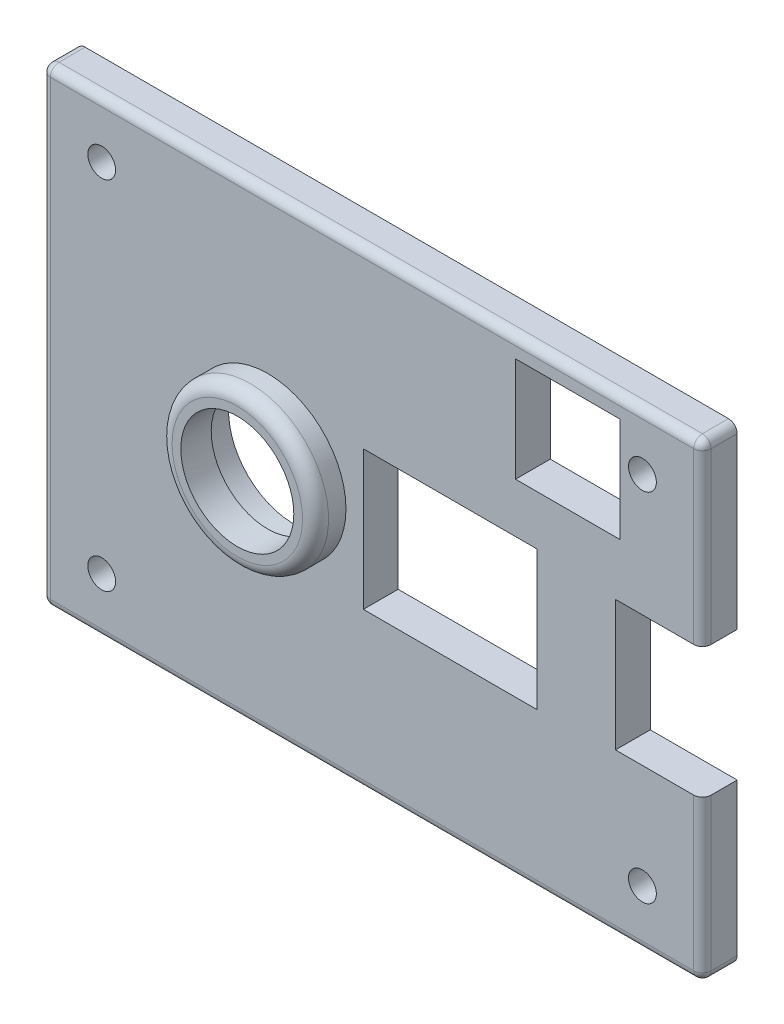
ISO-10303-21;
HEADER;
FILE_DESCRIPTION(('STEP AP214'),'2;1');
FILE_NAME('part.step','',(''),(''),'','','');
FILE_SCHEMA(('AUTOMOTIVE_DESIGN { 1 0 10303 214 1 1 1 1 }'));
ENDSEC;
DATA;
#1=APPLICATION_CONTEXT('core data for automotive mechanical design processes');
#2=APPLICATION_PROTOCOL_DEFINITION('international standard','automotive_design',2000,#1);
#3=PRODUCT_CONTEXT('',#1,'mechanical');
#4=PRODUCT('Part','Part','',(#3));
#5=PRODUCT_RELATED_PRODUCT_CATEGORY('part','',(#4));
#6=PRODUCT_DEFINITION_FORMATION('','',#4);
#7=PRODUCT_DEFINITION_CONTEXT('part definition',#1,'design');
#8=PRODUCT_DEFINITION('design','',#6,#7);
#9=PRODUCT_DEFINITION_SHAPE('','',#8);
#10=(LENGTH_UNIT() NAMED_UNIT(*) SI_UNIT(.MILLI.,.METRE.));
#11=(NAMED_UNIT(*) PLANE_ANGLE_UNIT() SI_UNIT($,.RADIAN.));
#12=(NAMED_UNIT(*) SI_UNIT($,.STERADIAN.) SOLID_ANGLE_UNIT());
#13=UNCERTAINTY_MEASURE_WITH_UNIT(LENGTH_MEASURE(1.E-05),#10,'distance_accuracy_value','');
#14=(GEOMETRIC_REPRESENTATION_CONTEXT(3) GLOBAL_UNCERTAINTY_ASSIGNED_CONTEXT((#13)) GLOBAL_UNIT_ASSIGNED_CONTEXT((#10,
#11,#12)) REPRESENTATION_CONTEXT('',''));
#15=CARTESIAN_POINT('',(0.,0.,0.));
#16=DIRECTION('',(0.,0.,1.));
#17=DIRECTION('',(1.,0.,0.));
#18=AXIS2_PLACEMENT_3D('',#15,#16,#17);
#19=CARTESIAN_POINT('',(38.,27.,4.));
#20=DIRECTION('',(-1.,0.,0.));
#21=DIRECTION('',(0.,-1.,0.));
#22=AXIS2_PLACEMENT_3D('',#19,#20,#21);
#23=PLANE('',#22);
#24=DIRECTION('',(0.,1.,0.));
#25=VECTOR('',#24,1.);
#26=CARTESIAN_POINT('',(38.,-26.,3.));
#27=LINE('',#26,#25);
#28=CARTESIAN_POINT('',(38.,-8.5,3.));
#29=VERTEX_POINT('',#28);
#30=CARTESIAN_POINT('',(38.,-26.,3.));
#31=VERTEX_POINT('',#30);
#32=EDGE_CURVE('E422',#29,#31,#27,.F.);
#33=ORIENTED_EDGE('',*,*,#32,.T.);
#34=DIRECTION('',(0.,0.,-1.));
#35=VECTOR('',#34,1.);
#36=CARTESIAN_POINT('',(38.,-26.,4.));
#37=LINE('',#36,#35);
#38=CARTESIAN_POINT('',(38.,-26.,0.));
#39=VERTEX_POINT('',#38);
#40=EDGE_CURVE('E429',#31,#39,#37,.T.);
#41=ORIENTED_EDGE('',*,*,#40,.T.);
#42=DIRECTION('',(0.,1.,0.));
#43=VECTOR('',#42,1.);
#44=CARTESIAN_POINT('',(38.,27.,0.));
#45=LINE('',#44,#43);
#46=CARTESIAN_POINT('',(38.,-8.5,0.));
#47=VERTEX_POINT('',#46);
#48=EDGE_CURVE('E343',#39,#47,#45,.T.);
#49=ORIENTED_EDGE('',*,*,#48,.T.);
#50=DIRECTION('',(0.,0.,1.));
#51=VECTOR('',#50,1.);
#52=CARTESIAN_POINT('',(38.,-8.5,0.));
#53=LINE('',#52,#51);
#54=EDGE_CURVE('E249',#47,#29,#53,.T.);
#55=ORIENTED_EDGE('',*,*,#54,.T.);
#56=EDGE_LOOP('',(#33,#41,#49,#55));
#57=FACE_BOUND('',#56,.T.);
#58=ADVANCED_FACE('F39',(#57),#23,.F.);
#59=CARTESIAN_POINT('',(38.,6.5,0.));
#60=VERTEX_POINT('',#59);
#61=CARTESIAN_POINT('',(38.,26.,0.));
#62=VERTEX_POINT('',#61);
#63=EDGE_CURVE('E340',#60,#62,#45,.T.);
#64=ORIENTED_EDGE('',*,*,#63,.T.);
#65=DIRECTION('',(0.,0.,-1.));
#66=VECTOR('',#65,1.);
#67=CARTESIAN_POINT('',(38.,26.,4.));
#68=LINE('',#67,#66);
#69=CARTESIAN_POINT('',(38.,26.,3.));
#70=VERTEX_POINT('',#69);
#71=EDGE_CURVE('E414',#62,#70,#68,.F.);
#72=ORIENTED_EDGE('',*,*,#71,.T.);
#73=DIRECTION('',(0.,1.,0.));
#74=VECTOR('',#73,1.);
#75=CARTESIAN_POINT('',(38.,6.5,3.));
#76=LINE('',#75,#74);
#77=CARTESIAN_POINT('',(38.,6.5,3.));
#78=VERTEX_POINT('',#77);
#79=EDGE_CURVE('E412',#70,#78,#76,.F.);
#80=ORIENTED_EDGE('',*,*,#79,.T.);
#81=DIRECTION('',(0.,0.,1.));
#82=VECTOR('',#81,1.);
#83=CARTESIAN_POINT('',(38.,6.5,0.));
#84=LINE('',#83,#82);
#85=EDGE_CURVE('E274',#60,#78,#84,.T.);
#86=ORIENTED_EDGE('',*,*,#85,.F.);
#87=EDGE_LOOP('',(#64,#72,#80,#86));
#88=FACE_BOUND('',#87,.T.);
#89=ADVANCED_FACE('F499',(#88),#23,.F.);
#90=CARTESIAN_POINT('',(-38.,27.,4.));
#91=DIRECTION('',(0.,-1.,0.));
#92=DIRECTION('',(0.,0.,-1.));
#93=AXIS2_PLACEMENT_3D('',#90,#91,#92);
#94=PLANE('',#93);
#95=DIRECTION('',(-1.,0.,0.));
#96=VECTOR('',#95,1.);
#97=CARTESIAN_POINT('',(38.,27.,3.));
#98=LINE('',#97,#96);
#99=CARTESIAN_POINT('',(-37.,27.,3.));
#100=VERTEX_POINT('',#99);
#101=CARTESIAN_POINT('',(37.,27.,3.));
#102=VERTEX_POINT('',#101);
#103=EDGE_CURVE('E364',#100,#102,#98,.F.);
#104=ORIENTED_EDGE('',*,*,#103,.T.);
#105=DIRECTION('',(0.,0.,-1.));
#106=VECTOR('',#105,1.);
#107=CARTESIAN_POINT('',(37.,27.,4.));
#108=LINE('',#107,#106);
#109=CARTESIAN_POINT('',(37.,27.,0.));
#110=VERTEX_POINT('',#109);
#111=EDGE_CURVE('E395',#102,#110,#108,.T.);
#112=ORIENTED_EDGE('',*,*,#111,.T.);
#113=DIRECTION('',(-1.,0.,0.));
#114=VECTOR('',#113,1.);
#115=CARTESIAN_POINT('',(-38.,27.,0.));
#116=LINE('',#115,#114);
#117=CARTESIAN_POINT('',(-37.,27.,0.));
#118=VERTEX_POINT('',#117);
#119=EDGE_CURVE('E345',#110,#118,#116,.T.);
#120=ORIENTED_EDGE('',*,*,#119,.T.);
#121=DIRECTION('',(0.,0.,-1.));
#122=VECTOR('',#121,1.);
#123=CARTESIAN_POINT('',(-37.,27.,4.));
#124=LINE('',#123,#122);
#125=EDGE_CURVE('E383',#118,#100,#124,.F.);
#126=ORIENTED_EDGE('',*,*,#125,.T.);
#127=EDGE_LOOP('',(#104,#112,#120,#126));
#128=FACE_BOUND('',#127,.T.);
#129=ADVANCED_FACE('F504',(#128),#94,.F.);
#130=CARTESIAN_POINT('',(-38.,27.,4.));
#131=DIRECTION('',(1.,0.,0.));
#132=DIRECTION('',(0.,1.,0.));
#133=AXIS2_PLACEMENT_3D('',#130,#131,#132);
#134=PLANE('',#133);
#135=DIRECTION('',(0.,-1.,0.));
#136=VECTOR('',#135,1.);
#137=CARTESIAN_POINT('',(-38.,26.,3.));
#138=LINE('',#137,#136);
#139=CARTESIAN_POINT('',(-38.,-26.,3.));
#140=VERTEX_POINT('',#139);
#141=CARTESIAN_POINT('',(-38.,26.,3.));
#142=VERTEX_POINT('',#141);
#143=EDGE_CURVE('E371',#140,#142,#138,.F.);
#144=ORIENTED_EDGE('',*,*,#143,.T.);
#145=DIRECTION('',(0.,0.,-1.));
#146=VECTOR('',#145,1.);
#147=CARTESIAN_POINT('',(-38.,26.,4.));
#148=LINE('',#147,#146);
#149=CARTESIAN_POINT('',(-38.,26.,0.));
#150=VERTEX_POINT('',#149);
#151=EDGE_CURVE('E375',#142,#150,#148,.T.);
#152=ORIENTED_EDGE('',*,*,#151,.T.);
#153=DIRECTION('',(0.,-1.,0.));
#154=VECTOR('',#153,1.);
#155=CARTESIAN_POINT('',(-38.,27.,0.));
#156=LINE('',#155,#154);
#157=CARTESIAN_POINT('',(-38.,-26.,0.));
#158=VERTEX_POINT('',#157);
#159=EDGE_CURVE('E347',#150,#158,#156,.T.);
#160=ORIENTED_EDGE('',*,*,#159,.T.);
#161=DIRECTION('',(0.,0.,-1.));
#162=VECTOR('',#161,1.);
#163=CARTESIAN_POINT('',(-38.,-26.,4.));
#164=LINE('',#163,#162);
#165=EDGE_CURVE('E373',#158,#140,#164,.F.);
#166=ORIENTED_EDGE('',*,*,#165,.T.);
#167=EDGE_LOOP('',(#144,#152,#160,#166));
#168=FACE_BOUND('',#167,.T.);
#169=ADVANCED_FACE('F775',(#168),#134,.F.);
#170=CARTESIAN_POINT('',(-38.,-27.,4.));
#171=DIRECTION('',(0.,1.,0.));
#172=DIRECTION('',(0.,0.,1.));
#173=AXIS2_PLACEMENT_3D('',#170,#171,#172);
#174=PLANE('',#173);
#175=DIRECTION('',(1.,0.,0.));
#176=VECTOR('',#175,1.);
#177=CARTESIAN_POINT('',(-38.,-27.,0.));
#178=LINE('',#177,#176);
#179=CARTESIAN_POINT('',(-37.,-27.,0.));
#180=VERTEX_POINT('',#179);
#181=CARTESIAN_POINT('',(37.,-27.,0.));
#182=VERTEX_POINT('',#181);
#183=EDGE_CURVE('E350',#180,#182,#178,.T.);
#184=ORIENTED_EDGE('',*,*,#183,.T.);
#185=DIRECTION('',(0.,0.,-1.));
#186=VECTOR('',#185,1.);
#187=CARTESIAN_POINT('',(37.,-27.,4.));
#188=LINE('',#187,#186);
#189=CARTESIAN_POINT('',(37.,-27.,3.));
#190=VERTEX_POINT('',#189);
#191=EDGE_CURVE('E434',#182,#190,#188,.F.);
#192=ORIENTED_EDGE('',*,*,#191,.T.);
#193=DIRECTION('',(1.,0.,0.));
#194=VECTOR('',#193,1.);
#195=CARTESIAN_POINT('',(-38.,-27.,3.));
#196=LINE('',#195,#194);
#197=CARTESIAN_POINT('',(-37.,-27.,3.));
#198=VERTEX_POINT('',#197);
#199=EDGE_CURVE('E369',#190,#198,#196,.F.);
#200=ORIENTED_EDGE('',*,*,#199,.T.);
#201=DIRECTION('',(0.,0.,-1.));
#202=VECTOR('',#201,1.);
#203=CARTESIAN_POINT('',(-37.,-27.,4.));
#204=LINE('',#203,#202);
#205=EDGE_CURVE('E388',#198,#180,#204,.T.);
#206=ORIENTED_EDGE('',*,*,#205,.T.);
#207=EDGE_LOOP('',(#184,#192,#200,#206));
#208=FACE_BOUND('',#207,.T.);
#209=ADVANCED_FACE('F467',(#208),#174,.F.);
#210=CARTESIAN_POINT('',(0.,0.,4.));
#211=DIRECTION('',(0.,0.,1.));
#212=DIRECTION('',(1.,0.,0.));
#213=AXIS2_PLACEMENT_3D('',#210,#211,#212);
#214=PLANE('',#213);
#215=CARTESIAN_POINT('',(-12.,0.,4.));
#216=DIRECTION('',(0.,0.,1.));
#217=DIRECTION('',(1.,0.,0.));
#218=AXIS2_PLACEMENT_3D('',#215,#216,#217);
#219=CIRCLE('',#218,9.);
#220=CARTESIAN_POINT('',(-3.,0.,4.));
#221=VERTEX_POINT('',#220);
#222=EDGE_CURVE('E353',#221,#221,#219,.T.);
#223=ORIENTED_EDGE('',*,*,#222,.F.);
#224=EDGE_LOOP('',(#223));
#225=FACE_BOUND('',#224,.T.);
#226=DIRECTION('',(0.,1.,0.));
#227=VECTOR('',#226,1.);
#228=CARTESIAN_POINT('',(19.,7.,4.));
#229=LINE('',#228,#227);
#230=CARTESIAN_POINT('',(19.,-9.,4.));
#231=VERTEX_POINT('',#230);
#232=CARTESIAN_POINT('',(19.,7.,4.));
#233=VERTEX_POINT('',#232);
#234=EDGE_CURVE('E246',#231,#233,#229,.T.);
#235=ORIENTED_EDGE('',*,*,#234,.F.);
#236=DIRECTION('',(1.,0.,0.));
#237=VECTOR('',#236,1.);
#238=CARTESIAN_POINT('',(-1.00000000000002,-9.,4.));
#239=LINE('',#238,#237);
#240=CARTESIAN_POINT('',(-1.00000000000002,-9.,4.));
#241=VERTEX_POINT('',#240);
#242=EDGE_CURVE('E236',#241,#231,#239,.T.);
#243=ORIENTED_EDGE('',*,*,#242,.F.);
#244=DIRECTION('',(0.,-1.,0.));
#245=VECTOR('',#244,1.);
#246=CARTESIAN_POINT('',(-1.00000000000002,7.,4.));
#247=LINE('',#246,#245);
#248=CARTESIAN_POINT('',(-1.00000000000002,7.,4.));
#249=VERTEX_POINT('',#248);
#250=EDGE_CURVE('E252',#249,#241,#247,.T.);
#251=ORIENTED_EDGE('',*,*,#250,.F.);
#252=DIRECTION('',(-1.,0.,0.));
#253=VECTOR('',#252,1.);
#254=CARTESIAN_POINT('',(-1.00000000000002,7.,4.));
#255=LINE('',#254,#253);
#256=EDGE_CURVE('E248',#233,#249,#255,.T.);
#257=ORIENTED_EDGE('',*,*,#256,.F.);
#258=EDGE_LOOP('',(#235,#243,#251,#257));
#259=FACE_BOUND('',#258,.T.);
#260=DIRECTION('',(1.,0.,0.));
#261=VECTOR('',#260,1.);
#262=CARTESIAN_POINT('',(38.,-26.,4.));
#263=LINE('',#262,#261);
#264=CARTESIAN_POINT('',(-37.,-26.,4.));
#265=VERTEX_POINT('',#264);
#266=CARTESIAN_POINT('',(37.,-26.,4.));
#267=VERTEX_POINT('',#266);
#268=EDGE_CURVE('E367',#265,#267,#263,.T.);
#269=ORIENTED_EDGE('',*,*,#268,.T.);
#270=DIRECTION('',(0.,1.,0.));
#271=VECTOR('',#270,1.);
#272=CARTESIAN_POINT('',(37.,-8.5,4.));
#273=LINE('',#272,#271);
#274=CARTESIAN_POINT('',(37.,-8.5,4.));
#275=VERTEX_POINT('',#274);
#276=EDGE_CURVE('E48',#267,#275,#273,.T.);
#277=ORIENTED_EDGE('',*,*,#276,.T.);
#278=DIRECTION('',(1.,0.,0.));
#279=VECTOR('',#278,1.);
#280=CARTESIAN_POINT('',(28.,-8.5,4.));
#281=LINE('',#280,#279);
#282=CARTESIAN_POINT('',(28.,-8.5,4.));
#283=VERTEX_POINT('',#282);
#284=EDGE_CURVE('E268',#283,#275,#281,.T.);
#285=ORIENTED_EDGE('',*,*,#284,.F.);
#286=DIRECTION('',(0.,-1.,0.));
#287=VECTOR('',#286,1.);
#288=CARTESIAN_POINT('',(28.,6.5,4.));
#289=LINE('',#288,#287);
#290=CARTESIAN_POINT('',(28.,6.5,4.));
#291=VERTEX_POINT('',#290);
#292=EDGE_CURVE('E277',#291,#283,#289,.T.);
#293=ORIENTED_EDGE('',*,*,#292,.F.);
#294=DIRECTION('',(-1.,0.,0.));
#295=VECTOR('',#294,1.);
#296=CARTESIAN_POINT('',(28.,6.5,4.));
#297=LINE('',#296,#295);
#298=CARTESIAN_POINT('',(37.,6.5,4.));
#299=VERTEX_POINT('',#298);
#300=EDGE_CURVE('E275',#299,#291,#297,.T.);
#301=ORIENTED_EDGE('',*,*,#300,.F.);
#302=DIRECTION('',(0.,1.,0.));
#303=VECTOR('',#302,1.);
#304=CARTESIAN_POINT('',(37.,26.,4.));
#305=LINE('',#304,#303);
#306=CARTESIAN_POINT('',(37.,26.,4.));
#307=VERTEX_POINT('',#306);
#308=EDGE_CURVE('E418',#299,#307,#305,.T.);
#309=ORIENTED_EDGE('',*,*,#308,.T.);
#310=DIRECTION('',(-1.,0.,0.));
#311=VECTOR('',#310,1.);
#312=CARTESIAN_POINT('',(-38.,26.,4.));
#313=LINE('',#312,#311);
#314=CARTESIAN_POINT('',(-37.,26.,4.));
#315=VERTEX_POINT('',#314);
#316=EDGE_CURVE('E362',#307,#315,#313,.T.);
#317=ORIENTED_EDGE('',*,*,#316,.T.);
#318=DIRECTION('',(0.,-1.,0.));
#319=VECTOR('',#318,1.);
#320=CARTESIAN_POINT('',(-37.,-26.,4.));
#321=LINE('',#320,#319);
#322=EDGE_CURVE('E393',#315,#265,#321,.T.);
#323=ORIENTED_EDGE('',*,*,#322,.T.);
#324=EDGE_LOOP('',(#269,#277,#285,#293,#301,#309,#317,#323));
#325=FACE_BOUND('',#324,.T.);
#326=DIRECTION('',(0.,1.,0.));
#327=VECTOR('',#326,1.);
#328=CARTESIAN_POINT('',(28.5,24.714,4.));
#329=LINE('',#328,#327);
#330=CARTESIAN_POINT('',(28.5,12.714,4.));
#331=VERTEX_POINT('',#330);
#332=CARTESIAN_POINT('',(28.5,24.714,4.));
#333=VERTEX_POINT('',#332);
#334=EDGE_CURVE('E222',#331,#333,#329,.T.);
#335=ORIENTED_EDGE('',*,*,#334,.F.);
#336=DIRECTION('',(1.,0.,0.));
#337=VECTOR('',#336,1.);
#338=CARTESIAN_POINT('',(16.5,12.714,4.));
#339=LINE('',#338,#337);
#340=CARTESIAN_POINT('',(16.5,12.714,4.));
#341=VERTEX_POINT('',#340);
#342=EDGE_CURVE('E295',#341,#331,#339,.T.);
#343=ORIENTED_EDGE('',*,*,#342,.F.);
#344=DIRECTION('',(0.,-1.,0.));
#345=VECTOR('',#344,1.);
#346=CARTESIAN_POINT('',(16.5,24.714,4.));
#347=LINE('',#346,#345);
#348=CARTESIAN_POINT('',(16.5,24.714,4.));
#349=VERTEX_POINT('',#348);
#350=EDGE_CURVE('E307',#349,#341,#347,.T.);
#351=ORIENTED_EDGE('',*,*,#350,.F.);
#352=DIRECTION('',(-1.,0.,0.));
#353=VECTOR('',#352,1.);
#354=CARTESIAN_POINT('',(16.5,24.714,4.));
#355=LINE('',#354,#353);
#356=EDGE_CURVE('E223',#333,#349,#355,.T.);
#357=ORIENTED_EDGE('',*,*,#356,.F.);
#358=EDGE_LOOP('',(#335,#343,#351,#357));
#359=FACE_BOUND('',#358,.T.);
#360=CARTESIAN_POINT('',(-31.1,-20.5,4.));
#361=DIRECTION('',(0.,0.,1.));
#362=DIRECTION('',(1.,0.,0.));
#363=AXIS2_PLACEMENT_3D('',#360,#361,#362);
#364=CIRCLE('',#363,1.6);
#365=CARTESIAN_POINT('',(-29.5,-20.5,4.));
#366=VERTEX_POINT('',#365);
#367=EDGE_CURVE('E230',#366,#366,#364,.T.);
#368=ORIENTED_EDGE('',*,*,#367,.F.);
#369=EDGE_LOOP('',(#368));
#370=FACE_BOUND('',#369,.T.);
#371=CARTESIAN_POINT('',(31.1,-20.5,4.));
#372=DIRECTION('',(0.,0.,1.));
#373=DIRECTION('',(1.,0.,0.));
#374=AXIS2_PLACEMENT_3D('',#371,#372,#373);
#375=CIRCLE('',#374,1.6);
#376=CARTESIAN_POINT('',(32.7,-20.5,4.));
#377=VERTEX_POINT('',#376);
#378=EDGE_CURVE('E329',#377,#377,#375,.T.);
#379=ORIENTED_EDGE('',*,*,#378,.F.);
#380=EDGE_LOOP('',(#379));
#381=FACE_BOUND('',#380,.T.);
#382=CARTESIAN_POINT('',(31.1,20.5,4.));
#383=DIRECTION('',(0.,0.,1.));
#384=DIRECTION('',(1.,0.,0.));
#385=AXIS2_PLACEMENT_3D('',#382,#383,#384);
#386=CIRCLE('',#385,1.6);
#387=CARTESIAN_POINT('',(32.7,20.5,4.));
#388=VERTEX_POINT('',#387);
#389=EDGE_CURVE('E323',#388,#388,#386,.T.);
#390=ORIENTED_EDGE('',*,*,#389,.F.);
#391=EDGE_LOOP('',(#390));
#392=FACE_BOUND('',#391,.T.);
#393=CARTESIAN_POINT('',(-31.1,20.5,4.));
#394=DIRECTION('',(0.,0.,1.));
#395=DIRECTION('',(1.,0.,0.));
#396=AXIS2_PLACEMENT_3D('',#393,#394,#395);
#397=CIRCLE('',#396,1.6);
#398=CARTESIAN_POINT('',(-29.5,20.5,4.));
#399=VERTEX_POINT('',#398);
#400=EDGE_CURVE('E322',#399,#399,#397,.T.);
#401=ORIENTED_EDGE('',*,*,#400,.F.);
#402=EDGE_LOOP('',(#401));
#403=FACE_BOUND('',#402,.T.);
#404=ADVANCED_FACE('F464',(#225,#259,#325,#359,#370,#381,#392,#403),#214,.T.);
#405=CARTESIAN_POINT('',(0.,0.,0.));
#406=DIRECTION('',(0.,0.,1.));
#407=DIRECTION('',(1.,0.,0.));
#408=AXIS2_PLACEMENT_3D('',#405,#406,#407);
#409=PLANE('',#408);
#410=CARTESIAN_POINT('',(-13.,-1.,0.));
#411=DIRECTION('',(0.,0.,1.));
#412=DIRECTION('',(1.,0.,0.));
#413=AXIS2_PLACEMENT_3D('',#410,#411,#412);
#414=CIRCLE('',#413,7.5);
#415=CARTESIAN_POINT('',(-5.50000000000002,-1.,0.));
#416=VERTEX_POINT('',#415);
#417=EDGE_CURVE('E227',#416,#416,#414,.T.);
#418=ORIENTED_EDGE('',*,*,#417,.T.);
#419=EDGE_LOOP('',(#418));
#420=FACE_BOUND('',#419,.T.);
#421=DIRECTION('',(1.,0.,0.));
#422=VECTOR('',#421,1.);
#423=CARTESIAN_POINT('',(-1.00000000000002,-9.,0.));
#424=LINE('',#423,#422);
#425=CARTESIAN_POINT('',(-1.00000000000002,-9.,0.));
#426=VERTEX_POINT('',#425);
#427=CARTESIAN_POINT('',(19.,-9.,0.));
#428=VERTEX_POINT('',#427);
#429=EDGE_CURVE('E242',#426,#428,#424,.T.);
#430=ORIENTED_EDGE('',*,*,#429,.T.);
#431=DIRECTION('',(0.,1.,0.));
#432=VECTOR('',#431,1.);
#433=CARTESIAN_POINT('',(19.,7.,0.));
#434=LINE('',#433,#432);
#435=CARTESIAN_POINT('',(19.,7.,0.));
#436=VERTEX_POINT('',#435);
#437=EDGE_CURVE('E232',#428,#436,#434,.T.);
#438=ORIENTED_EDGE('',*,*,#437,.T.);
#439=DIRECTION('',(-1.,0.,0.));
#440=VECTOR('',#439,1.);
#441=CARTESIAN_POINT('',(-1.00000000000002,7.,0.));
#442=LINE('',#441,#440);
#443=CARTESIAN_POINT('',(-1.00000000000002,7.,0.));
#444=VERTEX_POINT('',#443);
#445=EDGE_CURVE('E235',#436,#444,#442,.T.);
#446=ORIENTED_EDGE('',*,*,#445,.T.);
#447=DIRECTION('',(0.,-1.,0.));
#448=VECTOR('',#447,1.);
#449=CARTESIAN_POINT('',(-1.00000000000002,7.,0.));
#450=LINE('',#449,#448);
#451=EDGE_CURVE('E239',#444,#426,#450,.T.);
#452=ORIENTED_EDGE('',*,*,#451,.T.);
#453=EDGE_LOOP('',(#430,#438,#446,#452));
#454=FACE_BOUND('',#453,.T.);
#455=DIRECTION('',(1.,0.,0.));
#456=VECTOR('',#455,1.);
#457=CARTESIAN_POINT('',(16.5,12.714,0.));
#458=LINE('',#457,#456);
#459=CARTESIAN_POINT('',(16.5,12.714,0.));
#460=VERTEX_POINT('',#459);
#461=CARTESIAN_POINT('',(28.5,12.714,0.));
#462=VERTEX_POINT('',#461);
#463=EDGE_CURVE('E301',#460,#462,#458,.T.);
#464=ORIENTED_EDGE('',*,*,#463,.T.);
#465=DIRECTION('',(0.,1.,0.));
#466=VECTOR('',#465,1.);
#467=CARTESIAN_POINT('',(28.5,24.714,0.));
#468=LINE('',#467,#466);
#469=CARTESIAN_POINT('',(28.5,24.714,0.));
#470=VERTEX_POINT('',#469);
#471=EDGE_CURVE('E291',#462,#470,#468,.T.);
#472=ORIENTED_EDGE('',*,*,#471,.T.);
#473=DIRECTION('',(-1.,0.,0.));
#474=VECTOR('',#473,1.);
#475=CARTESIAN_POINT('',(16.5,24.714,0.));
#476=LINE('',#475,#474);
#477=CARTESIAN_POINT('',(16.5,24.714,0.));
#478=VERTEX_POINT('',#477);
#479=EDGE_CURVE('E294',#470,#478,#476,.T.);
#480=ORIENTED_EDGE('',*,*,#479,.T.);
#481=DIRECTION('',(0.,-1.,0.));
#482=VECTOR('',#481,1.);
#483=CARTESIAN_POINT('',(16.5,24.714,0.));
#484=LINE('',#483,#482);
#485=EDGE_CURVE('E298',#478,#460,#484,.T.);
#486=ORIENTED_EDGE('',*,*,#485,.T.);
#487=EDGE_LOOP('',(#464,#472,#480,#486));
#488=FACE_BOUND('',#487,.T.);
#489=CARTESIAN_POINT('',(-31.1,-20.5,0.));
#490=DIRECTION('',(0.,0.,1.));
#491=DIRECTION('',(1.,0.,0.));
#492=AXIS2_PLACEMENT_3D('',#489,#490,#491);
#493=CIRCLE('',#492,1.6);
#494=CARTESIAN_POINT('',(-29.5,-20.5,0.));
#495=VERTEX_POINT('',#494);
#496=EDGE_CURVE('E332',#495,#495,#493,.T.);
#497=ORIENTED_EDGE('',*,*,#496,.T.);
#498=EDGE_LOOP('',(#497));
#499=FACE_BOUND('',#498,.T.);
#500=CARTESIAN_POINT('',(31.1,-20.5,0.));
#501=DIRECTION('',(0.,0.,1.));
#502=DIRECTION('',(1.,0.,0.));
#503=AXIS2_PLACEMENT_3D('',#500,#501,#502);
#504=CIRCLE('',#503,1.6);
#505=CARTESIAN_POINT('',(32.7,-20.5,0.));
#506=VERTEX_POINT('',#505);
#507=EDGE_CURVE('E326',#506,#506,#504,.T.);
#508=ORIENTED_EDGE('',*,*,#507,.T.);
#509=EDGE_LOOP('',(#508));
#510=FACE_BOUND('',#509,.T.);
#511=CARTESIAN_POINT('',(31.1,20.5,0.));
#512=DIRECTION('',(0.,0.,1.));
#513=DIRECTION('',(1.,0.,0.));
#514=AXIS2_PLACEMENT_3D('',#511,#512,#513);
#515=CIRCLE('',#514,1.6);
#516=CARTESIAN_POINT('',(32.7,20.5,0.));
#517=VERTEX_POINT('',#516);
#518=EDGE_CURVE('E319',#517,#517,#515,.T.);
#519=ORIENTED_EDGE('',*,*,#518,.T.);
#520=EDGE_LOOP('',(#519));
#521=FACE_BOUND('',#520,.T.);
#522=CARTESIAN_POINT('',(-31.1,20.5,0.));
#523=DIRECTION('',(0.,0.,1.));
#524=DIRECTION('',(1.,0.,0.));
#525=AXIS2_PLACEMENT_3D('',#522,#523,#524);
#526=CIRCLE('',#525,1.6);
#527=CARTESIAN_POINT('',(-29.5,20.5,0.));
#528=VERTEX_POINT('',#527);
#529=EDGE_CURVE('E337',#528,#528,#526,.T.);
#530=ORIENTED_EDGE('',*,*,#529,.T.);
#531=EDGE_LOOP('',(#530));
#532=FACE_BOUND('',#531,.T.);
#533=ORIENTED_EDGE('',*,*,#48,.F.);
#534=CARTESIAN_POINT('',(37.,-26.,0.));
#535=DIRECTION('',(0.,0.,1.));
#536=DIRECTION('',(1.,0.,0.));
#537=AXIS2_PLACEMENT_3D('',#534,#535,#536);
#538=CIRCLE('',#537,1.);
#539=EDGE_CURVE('E432',#39,#182,#538,.F.);
#540=ORIENTED_EDGE('',*,*,#539,.T.);
#541=ORIENTED_EDGE('',*,*,#183,.F.);
#542=CARTESIAN_POINT('',(-37.,-26.,0.));
#543=DIRECTION('',(0.,0.,1.));
#544=DIRECTION('',(1.,0.,0.));
#545=AXIS2_PLACEMENT_3D('',#542,#543,#544);
#546=CIRCLE('',#545,1.);
#547=EDGE_CURVE('E378',#180,#158,#546,.F.);
#548=ORIENTED_EDGE('',*,*,#547,.T.);
#549=ORIENTED_EDGE('',*,*,#159,.F.);
#550=CARTESIAN_POINT('',(-37.,26.,0.));
#551=DIRECTION('',(0.,0.,1.));
#552=DIRECTION('',(1.,0.,0.));
#553=AXIS2_PLACEMENT_3D('',#550,#551,#552);
#554=CIRCLE('',#553,1.);
#555=EDGE_CURVE('E380',#150,#118,#554,.F.);
#556=ORIENTED_EDGE('',*,*,#555,.T.);
#557=ORIENTED_EDGE('',*,*,#119,.F.);
#558=CARTESIAN_POINT('',(37.,26.,0.));
#559=DIRECTION('',(0.,0.,1.));
#560=DIRECTION('',(1.,0.,0.));
#561=AXIS2_PLACEMENT_3D('',#558,#559,#560);
#562=CIRCLE('',#561,1.);
#563=EDGE_CURVE('E410',#110,#62,#562,.F.);
#564=ORIENTED_EDGE('',*,*,#563,.T.);
#565=ORIENTED_EDGE('',*,*,#63,.F.);
#566=DIRECTION('',(-1.,0.,0.));
#567=VECTOR('',#566,1.);
#568=CARTESIAN_POINT('',(28.,6.5,0.));
#569=LINE('',#568,#567);
#570=CARTESIAN_POINT('',(28.,6.5,0.));
#571=VERTEX_POINT('',#570);
#572=EDGE_CURVE('E264',#60,#571,#569,.T.);
#573=ORIENTED_EDGE('',*,*,#572,.T.);
#574=DIRECTION('',(0.,-1.,0.));
#575=VECTOR('',#574,1.);
#576=CARTESIAN_POINT('',(28.,6.5,0.));
#577=LINE('',#576,#575);
#578=CARTESIAN_POINT('',(28.,-8.5,0.));
#579=VERTEX_POINT('',#578);
#580=EDGE_CURVE('E267',#571,#579,#577,.T.);
#581=ORIENTED_EDGE('',*,*,#580,.T.);
#582=DIRECTION('',(1.,0.,0.));
#583=VECTOR('',#582,1.);
#584=CARTESIAN_POINT('',(28.,-8.5,0.));
#585=LINE('',#584,#583);
#586=EDGE_CURVE('E271',#579,#47,#585,.T.);
#587=ORIENTED_EDGE('',*,*,#586,.T.);
#588=EDGE_LOOP('',(#533,#540,#541,#548,#549,#556,#557,#564,#565,#573,#581,#587));
#589=FACE_BOUND('',#588,.T.);
#590=ADVANCED_FACE('F457',(#420,#454,#488,#499,#510,#521,#532,#589),#409,.F.);
#591=CARTESIAN_POINT('',(-31.1,20.5,0.));
#592=DIRECTION('',(0.,0.,1.));
#593=DIRECTION('',(1.,0.,0.));
#594=AXIS2_PLACEMENT_3D('',#591,#592,#593);
#595=CYLINDRICAL_SURFACE('',#594,1.6);
#596=ORIENTED_EDGE('',*,*,#529,.F.);
#597=EDGE_LOOP('',(#596));
#598=FACE_BOUND('',#597,.T.);
#599=ORIENTED_EDGE('',*,*,#400,.T.);
#600=EDGE_LOOP('',(#599));
#601=FACE_BOUND('',#600,.T.);
#602=ADVANCED_FACE('F482',(#598,#601),#595,.F.);
#603=CARTESIAN_POINT('',(31.1,20.5,0.));
#604=DIRECTION('',(0.,0.,1.));
#605=DIRECTION('',(1.,0.,0.));
#606=AXIS2_PLACEMENT_3D('',#603,#604,#605);
#607=CYLINDRICAL_SURFACE('',#606,1.6);
#608=ORIENTED_EDGE('',*,*,#518,.F.);
#609=EDGE_LOOP('',(#608));
#610=FACE_BOUND('',#609,.T.);
#611=ORIENTED_EDGE('',*,*,#389,.T.);
#612=EDGE_LOOP('',(#611));
#613=FACE_BOUND('',#612,.T.);
#614=ADVANCED_FACE('F484',(#610,#613),#607,.F.);
#615=CARTESIAN_POINT('',(31.1,-20.5,0.));
#616=DIRECTION('',(0.,0.,1.));
#617=DIRECTION('',(1.,0.,0.));
#618=AXIS2_PLACEMENT_3D('',#615,#616,#617);
#619=CYLINDRICAL_SURFACE('',#618,1.6);
#620=ORIENTED_EDGE('',*,*,#507,.F.);
#621=EDGE_LOOP('',(#620));
#622=FACE_BOUND('',#621,.T.);
#623=ORIENTED_EDGE('',*,*,#378,.T.);
#624=EDGE_LOOP('',(#623));
#625=FACE_BOUND('',#624,.T.);
#626=ADVANCED_FACE('F491',(#622,#625),#619,.F.);
#627=CARTESIAN_POINT('',(-31.1,-20.5,0.));
#628=DIRECTION('',(0.,0.,1.));
#629=DIRECTION('',(1.,0.,0.));
#630=AXIS2_PLACEMENT_3D('',#627,#628,#629);
#631=CYLINDRICAL_SURFACE('',#630,1.6);
#632=ORIENTED_EDGE('',*,*,#496,.F.);
#633=EDGE_LOOP('',(#632));
#634=FACE_BOUND('',#633,.T.);
#635=ORIENTED_EDGE('',*,*,#367,.T.);
#636=EDGE_LOOP('',(#635));
#637=FACE_BOUND('',#636,.T.);
#638=ADVANCED_FACE('F733',(#634,#637),#631,.F.);
#639=CARTESIAN_POINT('',(28.5,24.714,0.));
#640=DIRECTION('',(1.,0.,0.));
#641=DIRECTION('',(0.,0.,-1.));
#642=AXIS2_PLACEMENT_3D('',#639,#640,#641);
#643=PLANE('',#642);
#644=ORIENTED_EDGE('',*,*,#334,.T.);
#645=DIRECTION('',(0.,0.,1.));
#646=VECTOR('',#645,1.);
#647=CARTESIAN_POINT('',(28.5,24.714,0.));
#648=LINE('',#647,#646);
#649=EDGE_CURVE('E303',#470,#333,#648,.T.);
#650=ORIENTED_EDGE('',*,*,#649,.F.);
#651=ORIENTED_EDGE('',*,*,#471,.F.);
#652=DIRECTION('',(0.,0.,1.));
#653=VECTOR('',#652,1.);
#654=CARTESIAN_POINT('',(28.5,12.714,0.));
#655=LINE('',#654,#653);
#656=EDGE_CURVE('E278',#462,#331,#655,.T.);
#657=ORIENTED_EDGE('',*,*,#656,.T.);
#658=EDGE_LOOP('',(#644,#650,#651,#657));
#659=FACE_BOUND('',#658,.T.);
#660=ADVANCED_FACE('F725',(#659),#643,.F.);
#661=CARTESIAN_POINT('',(16.5,12.714,0.));
#662=DIRECTION('',(0.,-1.,0.));
#663=DIRECTION('',(0.,0.,-1.));
#664=AXIS2_PLACEMENT_3D('',#661,#662,#663);
#665=PLANE('',#664);
#666=ORIENTED_EDGE('',*,*,#342,.T.);
#667=ORIENTED_EDGE('',*,*,#656,.F.);
#668=ORIENTED_EDGE('',*,*,#463,.F.);
#669=DIRECTION('',(0.,0.,1.));
#670=VECTOR('',#669,1.);
#671=CARTESIAN_POINT('',(16.5,12.714,0.));
#672=LINE('',#671,#670);
#673=EDGE_CURVE('E313',#460,#341,#672,.T.);
#674=ORIENTED_EDGE('',*,*,#673,.T.);
#675=EDGE_LOOP('',(#666,#667,#668,#674));
#676=FACE_BOUND('',#675,.T.);
#677=ADVANCED_FACE('F717',(#676),#665,.F.);
#678=CARTESIAN_POINT('',(16.5,24.714,0.));
#679=DIRECTION('',(-1.,0.,0.));
#680=DIRECTION('',(0.,-1.,0.));
#681=AXIS2_PLACEMENT_3D('',#678,#679,#680);
#682=PLANE('',#681);
#683=ORIENTED_EDGE('',*,*,#350,.T.);
#684=ORIENTED_EDGE('',*,*,#673,.F.);
#685=ORIENTED_EDGE('',*,*,#485,.F.);
#686=DIRECTION('',(0.,0.,1.));
#687=VECTOR('',#686,1.);
#688=CARTESIAN_POINT('',(16.5,24.714,0.));
#689=LINE('',#688,#687);
#690=EDGE_CURVE('E315',#478,#349,#689,.T.);
#691=ORIENTED_EDGE('',*,*,#690,.T.);
#692=EDGE_LOOP('',(#683,#684,#685,#691));
#693=FACE_BOUND('',#692,.T.);
#694=ADVANCED_FACE('F709',(#693),#682,.F.);
#695=CARTESIAN_POINT('',(16.5,24.714,0.));
#696=DIRECTION('',(0.,1.,0.));
#697=DIRECTION('',(0.,0.,1.));
#698=AXIS2_PLACEMENT_3D('',#695,#696,#697);
#699=PLANE('',#698);
#700=ORIENTED_EDGE('',*,*,#356,.T.);
#701=ORIENTED_EDGE('',*,*,#690,.F.);
#702=ORIENTED_EDGE('',*,*,#479,.F.);
#703=ORIENTED_EDGE('',*,*,#649,.T.);
#704=EDGE_LOOP('',(#700,#701,#702,#703));
#705=FACE_BOUND('',#704,.T.);
#706=ADVANCED_FACE('F702',(#705),#699,.F.);
#707=CARTESIAN_POINT('',(28.,-8.5,0.));
#708=DIRECTION('',(0.,-1.,0.));
#709=DIRECTION('',(0.,0.,-1.));
#710=AXIS2_PLACEMENT_3D('',#707,#708,#709);
#711=PLANE('',#710);
#712=ORIENTED_EDGE('',*,*,#284,.T.);
#713=CARTESIAN_POINT('',(37.,-8.5,3.));
#714=DIRECTION('',(0.,-1.,0.));
#715=DIRECTION('',(0.,0.,-1.));
#716=AXIS2_PLACEMENT_3D('',#713,#714,#715);
#717=CIRCLE('',#716,1.);
#718=EDGE_CURVE('E11',#275,#29,#717,.F.);
#719=ORIENTED_EDGE('',*,*,#718,.T.);
#720=ORIENTED_EDGE('',*,*,#54,.F.);
#721=ORIENTED_EDGE('',*,*,#586,.F.);
#722=DIRECTION('',(0.,0.,1.));
#723=VECTOR('',#722,1.);
#724=CARTESIAN_POINT('',(28.,-8.5,0.));
#725=LINE('',#724,#723);
#726=EDGE_CURVE('E284',#579,#283,#725,.T.);
#727=ORIENTED_EDGE('',*,*,#726,.T.);
#728=EDGE_LOOP('',(#712,#719,#720,#721,#727));
#729=FACE_BOUND('',#728,.T.);
#730=ADVANCED_FACE('F452',(#729),#711,.F.);
#731=CARTESIAN_POINT('',(28.,6.5,0.));
#732=DIRECTION('',(-1.,0.,0.));
#733=DIRECTION('',(0.,0.,1.));
#734=AXIS2_PLACEMENT_3D('',#731,#732,#733);
#735=PLANE('',#734);
#736=ORIENTED_EDGE('',*,*,#292,.T.);
#737=ORIENTED_EDGE('',*,*,#726,.F.);
#738=ORIENTED_EDGE('',*,*,#580,.F.);
#739=DIRECTION('',(0.,0.,1.));
#740=VECTOR('',#739,1.);
#741=CARTESIAN_POINT('',(28.,6.5,0.));
#742=LINE('',#741,#740);
#743=EDGE_CURVE('E286',#571,#291,#742,.T.);
#744=ORIENTED_EDGE('',*,*,#743,.T.);
#745=EDGE_LOOP('',(#736,#737,#738,#744));
#746=FACE_BOUND('',#745,.T.);
#747=ADVANCED_FACE('F461',(#746),#735,.F.);
#748=CARTESIAN_POINT('',(28.,6.5,0.));
#749=DIRECTION('',(0.,1.,0.));
#750=DIRECTION('',(-1.,0.,0.));
#751=AXIS2_PLACEMENT_3D('',#748,#749,#750);
#752=PLANE('',#751);
#753=ORIENTED_EDGE('',*,*,#85,.T.);
#754=CARTESIAN_POINT('',(37.,6.5,3.));
#755=DIRECTION('',(0.,1.,0.));
#756=DIRECTION('',(-1.,0.,0.));
#757=AXIS2_PLACEMENT_3D('',#754,#755,#756);
#758=CIRCLE('',#757,1.);
#759=EDGE_CURVE('E420',#78,#299,#758,.F.);
#760=ORIENTED_EDGE('',*,*,#759,.T.);
#761=ORIENTED_EDGE('',*,*,#300,.T.);
#762=ORIENTED_EDGE('',*,*,#743,.F.);
#763=ORIENTED_EDGE('',*,*,#572,.F.);
#764=EDGE_LOOP('',(#753,#760,#761,#762,#763));
#765=FACE_BOUND('',#764,.T.);
#766=ADVANCED_FACE('F681',(#765),#752,.F.);
#767=CARTESIAN_POINT('',(19.,7.,0.));
#768=DIRECTION('',(1.,0.,0.));
#769=DIRECTION('',(0.,0.,-1.));
#770=AXIS2_PLACEMENT_3D('',#767,#768,#769);
#771=PLANE('',#770);
#772=ORIENTED_EDGE('',*,*,#234,.T.);
#773=DIRECTION('',(0.,0.,1.));
#774=VECTOR('',#773,1.);
#775=CARTESIAN_POINT('',(19.,7.,0.));
#776=LINE('',#775,#774);
#777=EDGE_CURVE('E245',#436,#233,#776,.T.);
#778=ORIENTED_EDGE('',*,*,#777,.F.);
#779=ORIENTED_EDGE('',*,*,#437,.F.);
#780=DIRECTION('',(0.,0.,1.));
#781=VECTOR('',#780,1.);
#782=CARTESIAN_POINT('',(19.,-9.,0.));
#783=LINE('',#782,#781);
#784=EDGE_CURVE('E231',#428,#231,#783,.T.);
#785=ORIENTED_EDGE('',*,*,#784,.T.);
#786=EDGE_LOOP('',(#772,#778,#779,#785));
#787=FACE_BOUND('',#786,.T.);
#788=ADVANCED_FACE('F673',(#787),#771,.F.);
#789=CARTESIAN_POINT('',(-1.00000000000002,-9.,0.));
#790=DIRECTION('',(0.,-1.,0.));
#791=DIRECTION('',(0.,0.,-1.));
#792=AXIS2_PLACEMENT_3D('',#789,#790,#791);
#793=PLANE('',#792);
#794=ORIENTED_EDGE('',*,*,#242,.T.);
#795=ORIENTED_EDGE('',*,*,#784,.F.);
#796=ORIENTED_EDGE('',*,*,#429,.F.);
#797=DIRECTION('',(0.,0.,1.));
#798=VECTOR('',#797,1.);
#799=CARTESIAN_POINT('',(-1.00000000000002,-9.,0.));
#800=LINE('',#799,#798);
#801=EDGE_CURVE('E258',#426,#241,#800,.T.);
#802=ORIENTED_EDGE('',*,*,#801,.T.);
#803=EDGE_LOOP('',(#794,#795,#796,#802));
#804=FACE_BOUND('',#803,.T.);
#805=ADVANCED_FACE('F665',(#804),#793,.F.);
#806=CARTESIAN_POINT('',(-1.00000000000002,7.,0.));
#807=DIRECTION('',(-1.,0.,0.));
#808=DIRECTION('',(0.,-1.,0.));
#809=AXIS2_PLACEMENT_3D('',#806,#807,#808);
#810=PLANE('',#809);
#811=ORIENTED_EDGE('',*,*,#250,.T.);
#812=ORIENTED_EDGE('',*,*,#801,.F.);
#813=ORIENTED_EDGE('',*,*,#451,.F.);
#814=DIRECTION('',(0.,0.,1.));
#815=VECTOR('',#814,1.);
#816=CARTESIAN_POINT('',(-1.00000000000002,7.,0.));
#817=LINE('',#816,#815);
#818=EDGE_CURVE('E260',#444,#249,#817,.T.);
#819=ORIENTED_EDGE('',*,*,#818,.T.);
#820=EDGE_LOOP('',(#811,#812,#813,#819));
#821=FACE_BOUND('',#820,.T.);
#822=ADVANCED_FACE('F657',(#821),#810,.F.);
#823=CARTESIAN_POINT('',(-1.00000000000002,7.,0.));
#824=DIRECTION('',(0.,1.,0.));
#825=DIRECTION('',(0.,0.,1.));
#826=AXIS2_PLACEMENT_3D('',#823,#824,#825);
#827=PLANE('',#826);
#828=ORIENTED_EDGE('',*,*,#256,.T.);
#829=ORIENTED_EDGE('',*,*,#818,.F.);
#830=ORIENTED_EDGE('',*,*,#445,.F.);
#831=ORIENTED_EDGE('',*,*,#777,.T.);
#832=EDGE_LOOP('',(#828,#829,#830,#831));
#833=FACE_BOUND('',#832,.T.);
#834=ADVANCED_FACE('F649',(#833),#827,.F.);
#835=CARTESIAN_POINT('',(-13.,-1.,0.));
#836=DIRECTION('',(0.,0.,1.));
#837=DIRECTION('',(1.,0.,0.));
#838=AXIS2_PLACEMENT_3D('',#835,#836,#837);
#839=CYLINDRICAL_SURFACE('',#838,7.5);
#840=ORIENTED_EDGE('',*,*,#417,.F.);
#841=EDGE_LOOP('',(#840));
#842=FACE_BOUND('',#841,.T.);
#843=CARTESIAN_POINT('',(-13.,-1.,4.));
#844=DIRECTION('',(0.,0.,-1.));
#845=DIRECTION('',(-1.,0.,0.));
#846=AXIS2_PLACEMENT_3D('',#843,#844,#845);
#847=CIRCLE('',#846,7.5);
#848=CARTESIAN_POINT('',(-5.51790293070398,-0.482097069296164,4.));
#849=VERTEX_POINT('',#848);
#850=CARTESIAN_POINT('',(-12.4820970692961,6.48209706929603,4.));
#851=VERTEX_POINT('',#850);
#852=EDGE_CURVE('E206',#849,#851,#847,.F.);
#853=ORIENTED_EDGE('',*,*,#852,.T.);
#854=EDGE_CURVE('E217',#851,#849,#847,.F.);
#855=ORIENTED_EDGE('',*,*,#854,.T.);
#856=EDGE_LOOP('',(#853,#855));
#857=FACE_BOUND('',#856,.T.);
#858=ADVANCED_FACE('F221',(#842,#857),#839,.F.);
#859=CARTESIAN_POINT('',(-12.,0.,4.));
#860=DIRECTION('',(0.,0.,-1.));
#861=DIRECTION('',(-1.,0.,0.));
#862=AXIS2_PLACEMENT_3D('',#859,#860,#861);
#863=PLANE('',#862);
#864=ORIENTED_EDGE('',*,*,#854,.F.);
#865=CARTESIAN_POINT('',(-12.,0.,4.));
#866=DIRECTION('',(0.,0.,1.));
#867=DIRECTION('',(1.,0.,0.));
#868=AXIS2_PLACEMENT_3D('',#865,#866,#867);
#869=CIRCLE('',#868,6.5);
#870=EDGE_CURVE('E209',#851,#849,#869,.T.);
#871=ORIENTED_EDGE('',*,*,#870,.T.);
#872=EDGE_LOOP('',(#864,#871));
#873=FACE_BOUND('',#872,.T.);
#874=ADVANCED_FACE('F218',(#873),#863,.T.);
#875=CARTESIAN_POINT('',(-12.,0.,7.5));
#876=DIRECTION('',(0.,0.,-1.));
#877=DIRECTION('',(-1.,0.,0.));
#878=AXIS2_PLACEMENT_3D('',#875,#876,#877);
#879=CYLINDRICAL_SURFACE('',#878,9.);
#880=CARTESIAN_POINT('',(-12.,0.,6.));
#881=DIRECTION('',(0.,0.,-1.));
#882=DIRECTION('',(-1.,0.,0.));
#883=AXIS2_PLACEMENT_3D('',#880,#881,#882);
#884=CIRCLE('',#883,9.);
#885=CARTESIAN_POINT('',(-21.,0.,6.));
#886=VERTEX_POINT('',#885);
#887=EDGE_CURVE('E356',#886,#886,#884,.T.);
#888=ORIENTED_EDGE('',*,*,#887,.T.);
#889=EDGE_LOOP('',(#888));
#890=FACE_BOUND('',#889,.T.);
#891=ORIENTED_EDGE('',*,*,#222,.T.);
#892=EDGE_LOOP('',(#891));
#893=FACE_BOUND('',#892,.T.);
#894=ADVANCED_FACE('F630',(#890,#893),#879,.T.);
#895=CARTESIAN_POINT('',(-12.,0.,7.5));
#896=DIRECTION('',(0.,0.,-1.));
#897=DIRECTION('',(-1.,0.,0.));
#898=AXIS2_PLACEMENT_3D('',#895,#896,#897);
#899=PLANE('',#898);
#900=CARTESIAN_POINT('',(-12.,0.,7.5));
#901=DIRECTION('',(0.,0.,-1.));
#902=DIRECTION('',(-1.,0.,0.));
#903=AXIS2_PLACEMENT_3D('',#900,#901,#902);
#904=CIRCLE('',#903,7.5);
#905=CARTESIAN_POINT('',(-19.5,0.,7.5));
#906=VERTEX_POINT('',#905);
#907=EDGE_CURVE('E359',#906,#906,#904,.F.);
#908=ORIENTED_EDGE('',*,*,#907,.T.);
#909=EDGE_LOOP('',(#908));
#910=FACE_BOUND('',#909,.T.);
#911=CARTESIAN_POINT('',(-12.,0.,7.5));
#912=DIRECTION('',(0.,0.,1.));
#913=DIRECTION('',(1.,0.,0.));
#914=AXIS2_PLACEMENT_3D('',#911,#912,#913);
#915=CIRCLE('',#914,6.5);
#916=CARTESIAN_POINT('',(-5.5,0.,7.5));
#917=VERTEX_POINT('',#916);
#918=EDGE_CURVE('E216',#917,#917,#915,.T.);
#919=ORIENTED_EDGE('',*,*,#918,.F.);
#920=EDGE_LOOP('',(#919));
#921=FACE_BOUND('',#920,.T.);
#922=ADVANCED_FACE('F622',(#910,#921),#899,.F.);
#923=CARTESIAN_POINT('',(-12.,0.,7.5));
#924=DIRECTION('',(0.,0.,-1.));
#925=DIRECTION('',(-1.,0.,0.));
#926=AXIS2_PLACEMENT_3D('',#923,#924,#925);
#927=CYLINDRICAL_SURFACE('',#926,6.5);
#928=ORIENTED_EDGE('',*,*,#918,.T.);
#929=EDGE_LOOP('',(#928));
#930=FACE_BOUND('',#929,.T.);
#931=ORIENTED_EDGE('',*,*,#870,.F.);
#932=EDGE_CURVE('E202',#849,#851,#869,.T.);
#933=ORIENTED_EDGE('',*,*,#932,.F.);
#934=EDGE_LOOP('',(#931,#933));
#935=FACE_BOUND('',#934,.T.);
#936=ADVANCED_FACE('F213',(#930,#935),#927,.F.);
#937=CARTESIAN_POINT('',(-12.,0.,4.));
#938=DIRECTION('',(0.,0.,1.));
#939=DIRECTION('',(1.,0.,0.));
#940=AXIS2_PLACEMENT_3D('',#937,#938,#939);
#941=PLANE('',#940);
#942=ORIENTED_EDGE('',*,*,#932,.T.);
#943=ORIENTED_EDGE('',*,*,#852,.F.);
#944=EDGE_LOOP('',(#942,#943));
#945=FACE_BOUND('',#944,.T.);
#946=ADVANCED_FACE('F204',(#945),#941,.T.);
#947=CARTESIAN_POINT('',(-12.,0.,6.));
#948=DIRECTION('',(0.,0.,-1.));
#949=DIRECTION('',(-1.,0.,0.));
#950=AXIS2_PLACEMENT_3D('',#947,#948,#949);
#951=TOROIDAL_SURFACE('',#950,7.5,1.5);
#952=ORIENTED_EDGE('',*,*,#907,.F.);
#953=EDGE_LOOP('',(#952));
#954=FACE_BOUND('',#953,.T.);
#955=ORIENTED_EDGE('',*,*,#887,.F.);
#956=EDGE_LOOP('',(#955));
#957=FACE_BOUND('',#956,.T.);
#958=ADVANCED_FACE('F509',(#954,#957),#951,.T.);
#959=CARTESIAN_POINT('',(0.,26.,3.));
#960=DIRECTION('',(1.,0.,0.));
#961=DIRECTION('',(0.,0.,-1.));
#962=AXIS2_PLACEMENT_3D('',#959,#960,#961);
#963=CYLINDRICAL_SURFACE('',#962,1.);
#964=ORIENTED_EDGE('',*,*,#316,.F.);
#965=CARTESIAN_POINT('',(37.,26.,3.));
#966=DIRECTION('',(1.,0.,0.));
#967=DIRECTION('',(0.,0.,-1.));
#968=AXIS2_PLACEMENT_3D('',#965,#966,#967);
#969=CIRCLE('',#968,1.);
#970=EDGE_CURVE('E416',#307,#102,#969,.F.);
#971=ORIENTED_EDGE('',*,*,#970,.T.);
#972=ORIENTED_EDGE('',*,*,#103,.F.);
#973=CARTESIAN_POINT('',(-37.,26.,3.));
#974=DIRECTION('',(1.,0.,0.));
#975=DIRECTION('',(0.,0.,-1.));
#976=AXIS2_PLACEMENT_3D('',#973,#974,#975);
#977=CIRCLE('',#976,1.);
#978=EDGE_CURVE('E385',#100,#315,#977,.T.);
#979=ORIENTED_EDGE('',*,*,#978,.T.);
#980=EDGE_LOOP('',(#964,#971,#972,#979));
#981=FACE_BOUND('',#980,.T.);
#982=ADVANCED_FACE('F512',(#981),#963,.T.);
#983=CARTESIAN_POINT('',(0.,-26.,3.));
#984=DIRECTION('',(-1.,0.,0.));
#985=DIRECTION('',(0.,0.,1.));
#986=AXIS2_PLACEMENT_3D('',#983,#984,#985);
#987=CYLINDRICAL_SURFACE('',#986,1.);
#988=ORIENTED_EDGE('',*,*,#199,.F.);
#989=CARTESIAN_POINT('',(37.,-26.,3.));
#990=DIRECTION('',(-1.,0.,0.));
#991=DIRECTION('',(0.,0.,1.));
#992=AXIS2_PLACEMENT_3D('',#989,#990,#991);
#993=CIRCLE('',#992,1.);
#994=EDGE_CURVE('E63',#190,#267,#993,.T.);
#995=ORIENTED_EDGE('',*,*,#994,.T.);
#996=ORIENTED_EDGE('',*,*,#268,.F.);
#997=CARTESIAN_POINT('',(-37.,-26.,3.));
#998=DIRECTION('',(-1.,0.,0.));
#999=DIRECTION('',(0.,0.,1.));
#1000=AXIS2_PLACEMENT_3D('',#997,#998,#999);
#1001=CIRCLE('',#1000,1.);
#1002=EDGE_CURVE('E390',#265,#198,#1001,.F.);
#1003=ORIENTED_EDGE('',*,*,#1002,.T.);
#1004=EDGE_LOOP('',(#988,#995,#996,#1003));
#1005=FACE_BOUND('',#1004,.T.);
#1006=ADVANCED_FACE('F516',(#1005),#987,.T.);
#1007=CARTESIAN_POINT('',(-37.,-26.,4.));
#1008=DIRECTION('',(0.,0.,-1.));
#1009=DIRECTION('',(-1.,0.,0.));
#1010=AXIS2_PLACEMENT_3D('',#1007,#1008,#1009);
#1011=CYLINDRICAL_SURFACE('',#1010,1.);
#1012=ORIENTED_EDGE('',*,*,#547,.F.);
#1013=ORIENTED_EDGE('',*,*,#205,.F.);
#1014=CARTESIAN_POINT('',(-37.,-26.,3.));
#1015=DIRECTION('',(0.,0.,1.));
#1016=DIRECTION('',(1.,0.,0.));
#1017=AXIS2_PLACEMENT_3D('',#1014,#1015,#1016);
#1018=CIRCLE('',#1017,1.);
#1019=EDGE_CURVE('E210',#140,#198,#1018,.T.);
#1020=ORIENTED_EDGE('',*,*,#1019,.F.);
#1021=ORIENTED_EDGE('',*,*,#165,.F.);
#1022=EDGE_LOOP('',(#1012,#1013,#1020,#1021));
#1023=FACE_BOUND('',#1022,.T.);
#1024=ADVANCED_FACE('F520',(#1023),#1011,.T.);
#1025=CARTESIAN_POINT('',(-37.,-26.,3.));
#1026=DIRECTION('',(1.,0.,0.));
#1027=DIRECTION('',(0.,1.,0.));
#1028=AXIS2_PLACEMENT_3D('',#1025,#1026,#1027);
#1029=SPHERICAL_SURFACE('',#1028,1.);
#1030=ORIENTED_EDGE('',*,*,#1019,.T.);
#1031=ORIENTED_EDGE('',*,*,#1002,.F.);
#1032=CARTESIAN_POINT('',(-37.,-26.,3.));
#1033=DIRECTION('',(0.,1.,0.));
#1034=DIRECTION('',(0.,0.,1.));
#1035=AXIS2_PLACEMENT_3D('',#1032,#1033,#1034);
#1036=CIRCLE('',#1035,1.);
#1037=EDGE_CURVE('E403',#140,#265,#1036,.T.);
#1038=ORIENTED_EDGE('',*,*,#1037,.F.);
#1039=EDGE_LOOP('',(#1030,#1031,#1038));
#1040=FACE_BOUND('',#1039,.T.);
#1041=ADVANCED_FACE('F533',(#1040),#1029,.T.);
#1042=CARTESIAN_POINT('',(-37.,0.,3.));
#1043=DIRECTION('',(0.,1.,0.));
#1044=DIRECTION('',(-1.,0.,0.));
#1045=AXIS2_PLACEMENT_3D('',#1042,#1043,#1044);
#1046=CYLINDRICAL_SURFACE('',#1045,1.);
#1047=ORIENTED_EDGE('',*,*,#1037,.T.);
#1048=ORIENTED_EDGE('',*,*,#322,.F.);
#1049=CARTESIAN_POINT('',(-37.,26.,3.));
#1050=DIRECTION('',(0.,1.,0.));
#1051=DIRECTION('',(0.,0.,1.));
#1052=AXIS2_PLACEMENT_3D('',#1049,#1050,#1051);
#1053=CIRCLE('',#1052,1.);
#1054=EDGE_CURVE('E399',#142,#315,#1053,.T.);
#1055=ORIENTED_EDGE('',*,*,#1054,.F.);
#1056=ORIENTED_EDGE('',*,*,#143,.F.);
#1057=EDGE_LOOP('',(#1047,#1048,#1055,#1056));
#1058=FACE_BOUND('',#1057,.T.);
#1059=ADVANCED_FACE('F529',(#1058),#1046,.T.);
#1060=CARTESIAN_POINT('',(-37.,26.,3.));
#1061=DIRECTION('',(1.,0.,0.));
#1062=DIRECTION('',(0.,1.,0.));
#1063=AXIS2_PLACEMENT_3D('',#1060,#1061,#1062);
#1064=SPHERICAL_SURFACE('',#1063,1.);
#1065=ORIENTED_EDGE('',*,*,#1054,.T.);
#1066=ORIENTED_EDGE('',*,*,#978,.F.);
#1067=CARTESIAN_POINT('',(-37.,26.,3.));
#1068=DIRECTION('',(0.,0.,-1.));
#1069=DIRECTION('',(-1.,0.,0.));
#1070=AXIS2_PLACEMENT_3D('',#1067,#1068,#1069);
#1071=CIRCLE('',#1070,1.);
#1072=EDGE_CURVE('E396',#142,#100,#1071,.T.);
#1073=ORIENTED_EDGE('',*,*,#1072,.F.);
#1074=EDGE_LOOP('',(#1065,#1066,#1073));
#1075=FACE_BOUND('',#1074,.T.);
#1076=ADVANCED_FACE('F525',(#1075),#1064,.T.);
#1077=CARTESIAN_POINT('',(-37.,26.,4.));
#1078=DIRECTION('',(0.,0.,-1.));
#1079=DIRECTION('',(-1.,0.,0.));
#1080=AXIS2_PLACEMENT_3D('',#1077,#1078,#1079);
#1081=CYLINDRICAL_SURFACE('',#1080,1.);
#1082=ORIENTED_EDGE('',*,*,#1072,.T.);
#1083=ORIENTED_EDGE('',*,*,#125,.F.);
#1084=ORIENTED_EDGE('',*,*,#555,.F.);
#1085=ORIENTED_EDGE('',*,*,#151,.F.);
#1086=EDGE_LOOP('',(#1082,#1083,#1084,#1085));
#1087=FACE_BOUND('',#1086,.T.);
#1088=ADVANCED_FACE('F521',(#1087),#1081,.T.);
#1089=CARTESIAN_POINT('',(37.,0.,3.));
#1090=DIRECTION('',(0.,-1.,0.));
#1091=DIRECTION('',(1.,0.,0.));
#1092=AXIS2_PLACEMENT_3D('',#1089,#1090,#1091);
#1093=CYLINDRICAL_SURFACE('',#1092,1.);
#1094=CARTESIAN_POINT('',(37.,26.,3.));
#1095=DIRECTION('',(0.,1.,0.));
#1096=DIRECTION('',(0.,0.,1.));
#1097=AXIS2_PLACEMENT_3D('',#1094,#1095,#1096);
#1098=CIRCLE('',#1097,1.);
#1099=EDGE_CURVE('E400',#307,#70,#1098,.T.);
#1100=ORIENTED_EDGE('',*,*,#1099,.F.);
#1101=ORIENTED_EDGE('',*,*,#308,.F.);
#1102=ORIENTED_EDGE('',*,*,#759,.F.);
#1103=ORIENTED_EDGE('',*,*,#79,.F.);
#1104=EDGE_LOOP('',(#1100,#1101,#1102,#1103));
#1105=FACE_BOUND('',#1104,.T.);
#1106=ADVANCED_FACE('F524',(#1105),#1093,.T.);
#1107=CARTESIAN_POINT('',(37.,26.,3.));
#1108=DIRECTION('',(-1.,0.,0.));
#1109=DIRECTION('',(0.,-1.,0.));
#1110=AXIS2_PLACEMENT_3D('',#1107,#1108,#1109);
#1111=SPHERICAL_SURFACE('',#1110,1.);
#1112=ORIENTED_EDGE('',*,*,#970,.F.);
#1113=ORIENTED_EDGE('',*,*,#1099,.T.);
#1114=CARTESIAN_POINT('',(37.,26.,3.));
#1115=DIRECTION('',(0.,0.,-1.));
#1116=DIRECTION('',(-1.,0.,0.));
#1117=AXIS2_PLACEMENT_3D('',#1114,#1115,#1116);
#1118=CIRCLE('',#1117,1.);
#1119=EDGE_CURVE('E423',#102,#70,#1118,.T.);
#1120=ORIENTED_EDGE('',*,*,#1119,.F.);
#1121=EDGE_LOOP('',(#1112,#1113,#1120));
#1122=FACE_BOUND('',#1121,.T.);
#1123=ADVANCED_FACE('F544',(#1122),#1111,.T.);
#1124=CARTESIAN_POINT('',(37.,26.,4.));
#1125=DIRECTION('',(0.,0.,-1.));
#1126=DIRECTION('',(-1.,0.,0.));
#1127=AXIS2_PLACEMENT_3D('',#1124,#1125,#1126);
#1128=CYLINDRICAL_SURFACE('',#1127,1.);
#1129=ORIENTED_EDGE('',*,*,#1119,.T.);
#1130=ORIENTED_EDGE('',*,*,#71,.F.);
#1131=ORIENTED_EDGE('',*,*,#563,.F.);
#1132=ORIENTED_EDGE('',*,*,#111,.F.);
#1133=EDGE_LOOP('',(#1129,#1130,#1131,#1132));
#1134=FACE_BOUND('',#1133,.T.);
#1135=ADVANCED_FACE('F541',(#1134),#1128,.T.);
#1136=CARTESIAN_POINT('',(37.,0.,3.));
#1137=DIRECTION('',(0.,-1.,0.));
#1138=DIRECTION('',(1.,0.,0.));
#1139=AXIS2_PLACEMENT_3D('',#1136,#1137,#1138);
#1140=CYLINDRICAL_SURFACE('',#1139,1.);
#1141=ORIENTED_EDGE('',*,*,#718,.F.);
#1142=ORIENTED_EDGE('',*,*,#276,.F.);
#1143=CARTESIAN_POINT('',(37.,-26.,3.));
#1144=DIRECTION('',(0.,-1.,0.));
#1145=DIRECTION('',(0.,0.,-1.));
#1146=AXIS2_PLACEMENT_3D('',#1143,#1144,#1145);
#1147=CIRCLE('',#1146,1.);
#1148=EDGE_CURVE('E43',#31,#267,#1147,.T.);
#1149=ORIENTED_EDGE('',*,*,#1148,.F.);
#1150=ORIENTED_EDGE('',*,*,#32,.F.);
#1151=EDGE_LOOP('',(#1141,#1142,#1149,#1150));
#1152=FACE_BOUND('',#1151,.T.);
#1153=ADVANCED_FACE('F41',(#1152),#1140,.T.);
#1154=CARTESIAN_POINT('',(37.,-26.,3.));
#1155=DIRECTION('',(-1.,0.,0.));
#1156=DIRECTION('',(0.,-1.,0.));
#1157=AXIS2_PLACEMENT_3D('',#1154,#1155,#1156);
#1158=SPHERICAL_SURFACE('',#1157,1.);
#1159=ORIENTED_EDGE('',*,*,#1148,.T.);
#1160=ORIENTED_EDGE('',*,*,#994,.F.);
#1161=CARTESIAN_POINT('',(37.,-26.,3.));
#1162=DIRECTION('',(0.,0.,-1.));
#1163=DIRECTION('',(-1.,0.,0.));
#1164=AXIS2_PLACEMENT_3D('',#1161,#1162,#1163);
#1165=CIRCLE('',#1164,1.);
#1166=EDGE_CURVE('E437',#31,#190,#1165,.T.);
#1167=ORIENTED_EDGE('',*,*,#1166,.F.);
#1168=EDGE_LOOP('',(#1159,#1160,#1167));
#1169=FACE_BOUND('',#1168,.T.);
#1170=ADVANCED_FACE('F446',(#1169),#1158,.T.);
#1171=CARTESIAN_POINT('',(37.,-26.,4.));
#1172=DIRECTION('',(0.,0.,-1.));
#1173=DIRECTION('',(-1.,0.,0.));
#1174=AXIS2_PLACEMENT_3D('',#1171,#1172,#1173);
#1175=CYLINDRICAL_SURFACE('',#1174,1.);
#1176=ORIENTED_EDGE('',*,*,#1166,.T.);
#1177=ORIENTED_EDGE('',*,*,#191,.F.);
#1178=ORIENTED_EDGE('',*,*,#539,.F.);
#1179=ORIENTED_EDGE('',*,*,#40,.F.);
#1180=EDGE_LOOP('',(#1176,#1177,#1178,#1179));
#1181=FACE_BOUND('',#1180,.T.);
#1182=ADVANCED_FACE('F552',(#1181),#1175,.T.);
#1183=CLOSED_SHELL('',(#58,#89,#129,#169,#209,#404,#590,#602,#614,#626,#638,#660,#677,#694,#706,
#730,#747,#766,#788,#805,#822,#834,#858,#874,#894,#922,#936,#946,#958,#982,#1006,#1024,#1041,
#1059,#1076,#1088,#1106,#1123,#1135,#1153,#1170,#1182));
#1184=MANIFOLD_SOLID_BREP('B2',#1183);
#1185=ADVANCED_BREP_SHAPE_REPRESENTATION('',(#18,#1184),#14);
#1186=SHAPE_DEFINITION_REPRESENTATION(#9,#1185);
ENDSEC;
END-ISO-10303-21;
